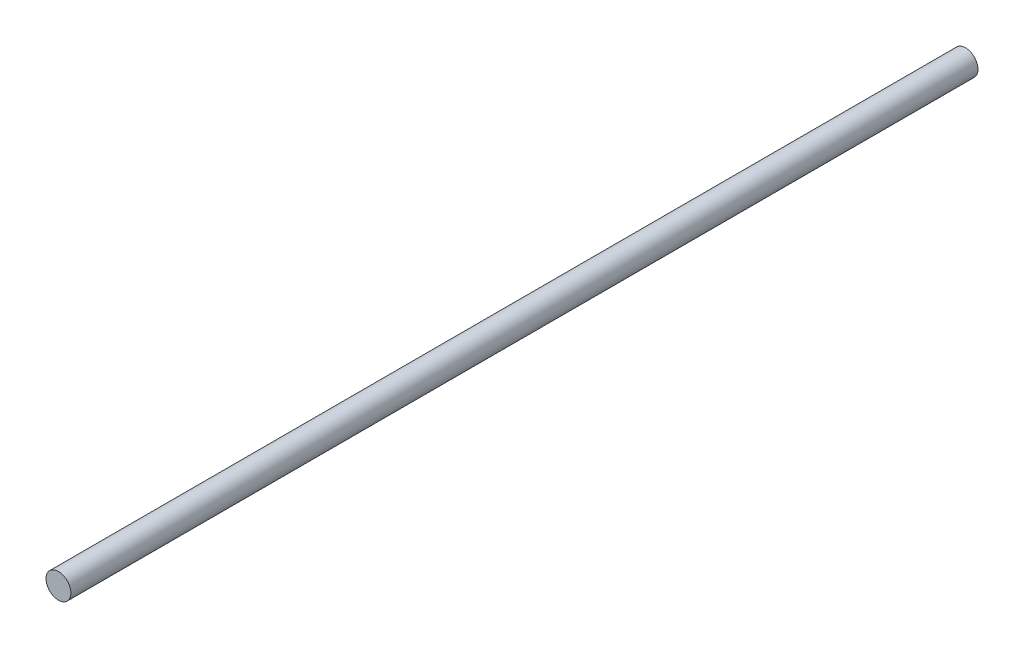
ISO-10303-21;
HEADER;
FILE_DESCRIPTION(('STEP AP214'),'2;1');
FILE_NAME('part.step','',(''),(''),'','','');
FILE_SCHEMA(('AUTOMOTIVE_DESIGN { 1 0 10303 214 1 1 1 1 }'));
ENDSEC;
DATA;
#1=APPLICATION_CONTEXT('core data for automotive mechanical design processes');
#2=APPLICATION_PROTOCOL_DEFINITION('international standard','automotive_design',2000,#1);
#3=PRODUCT_CONTEXT('',#1,'mechanical');
#4=PRODUCT('Part','Part','',(#3));
#5=PRODUCT_RELATED_PRODUCT_CATEGORY('part','',(#4));
#6=PRODUCT_DEFINITION_FORMATION('','',#4);
#7=PRODUCT_DEFINITION_CONTEXT('part definition',#1,'design');
#8=PRODUCT_DEFINITION('design','',#6,#7);
#9=PRODUCT_DEFINITION_SHAPE('','',#8);
#10=(LENGTH_UNIT() NAMED_UNIT(*) SI_UNIT(.MILLI.,.METRE.));
#11=(NAMED_UNIT(*) PLANE_ANGLE_UNIT() SI_UNIT($,.RADIAN.));
#12=(NAMED_UNIT(*) SI_UNIT($,.STERADIAN.) SOLID_ANGLE_UNIT());
#13=UNCERTAINTY_MEASURE_WITH_UNIT(LENGTH_MEASURE(1.E-05),#10,'distance_accuracy_value','');
#14=(GEOMETRIC_REPRESENTATION_CONTEXT(3) GLOBAL_UNCERTAINTY_ASSIGNED_CONTEXT((#13)) GLOBAL_UNIT_ASSIGNED_CONTEXT((#10,
#11,#12)) REPRESENTATION_CONTEXT('',''));
#15=CARTESIAN_POINT('',(0.,0.,0.));
#16=DIRECTION('',(0.,0.,1.));
#17=DIRECTION('',(1.,0.,0.));
#18=AXIS2_PLACEMENT_3D('',#15,#16,#17);
#19=CARTESIAN_POINT('',(0.,0.,51.));
#20=DIRECTION('',(0.,0.,-1.));
#21=DIRECTION('',(-1.,0.,0.));
#22=AXIS2_PLACEMENT_3D('',#19,#20,#21);
#23=CYLINDRICAL_SURFACE('',#22,0.699999999999999);
#24=CARTESIAN_POINT('',(0.,0.,51.));
#25=DIRECTION('',(0.,0.,1.));
#26=DIRECTION('',(1.,0.,0.));
#27=AXIS2_PLACEMENT_3D('',#24,#25,#26);
#28=CIRCLE('',#27,0.699999999999999);
#29=CARTESIAN_POINT('',(0.699999999999999,0.,51.));
#30=VERTEX_POINT('',#29);
#31=EDGE_CURVE('E10',#30,#30,#28,.T.);
#32=ORIENTED_EDGE('',*,*,#31,.F.);
#33=EDGE_LOOP('',(#32));
#34=FACE_BOUND('',#33,.T.);
#35=CARTESIAN_POINT('',(0.,0.,0.));
#36=DIRECTION('',(0.,0.,1.));
#37=DIRECTION('',(1.,0.,0.));
#38=AXIS2_PLACEMENT_3D('',#35,#36,#37);
#39=CIRCLE('',#38,0.699999999999999);
#40=CARTESIAN_POINT('',(0.699999999999999,0.,0.));
#41=VERTEX_POINT('',#40);
#42=EDGE_CURVE('E33',#41,#41,#39,.T.);
#43=ORIENTED_EDGE('',*,*,#42,.T.);
#44=EDGE_LOOP('',(#43));
#45=FACE_BOUND('',#44,.T.);
#46=ADVANCED_FACE('F30',(#34,#45),#23,.T.);
#47=CARTESIAN_POINT('',(0.,0.,51.));
#48=DIRECTION('',(0.,0.,1.));
#49=DIRECTION('',(1.,0.,0.));
#50=AXIS2_PLACEMENT_3D('',#47,#48,#49);
#51=PLANE('',#50);
#52=ORIENTED_EDGE('',*,*,#31,.T.);
#53=EDGE_LOOP('',(#52));
#54=FACE_BOUND('',#53,.T.);
#55=ADVANCED_FACE('F45',(#54),#51,.T.);
#56=CARTESIAN_POINT('',(0.,0.,0.));
#57=DIRECTION('',(0.,0.,1.));
#58=DIRECTION('',(1.,0.,0.));
#59=AXIS2_PLACEMENT_3D('',#56,#57,#58);
#60=PLANE('',#59);
#61=ORIENTED_EDGE('',*,*,#42,.F.);
#62=EDGE_LOOP('',(#61));
#63=FACE_BOUND('',#62,.T.);
#64=ADVANCED_FACE('F43',(#63),#60,.F.);
#65=CLOSED_SHELL('',(#46,#55,#64));
#66=MANIFOLD_SOLID_BREP('B2',#65);
#67=ADVANCED_BREP_SHAPE_REPRESENTATION('',(#18,#66),#14);
#68=SHAPE_DEFINITION_REPRESENTATION(#9,#67);
ENDSEC;
END-ISO-10303-21;
